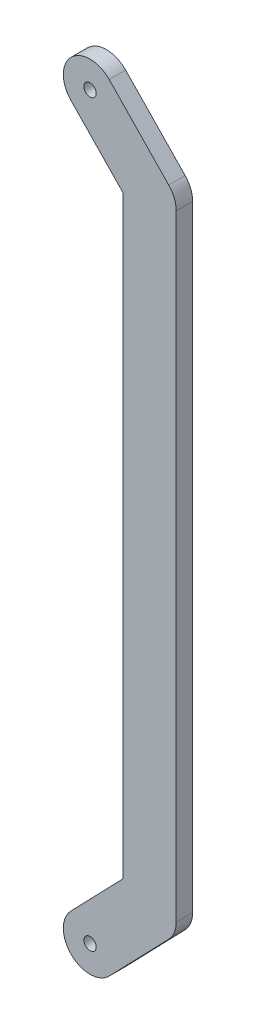
ISO-10303-21;
HEADER;
FILE_DESCRIPTION(('STEP AP214'),'2;1');
FILE_NAME('part.step','',(''),(''),'','','');
FILE_SCHEMA(('AUTOMOTIVE_DESIGN { 1 0 10303 214 1 1 1 1 }'));
ENDSEC;
DATA;
#1=APPLICATION_CONTEXT('core data for automotive mechanical design processes');
#2=APPLICATION_PROTOCOL_DEFINITION('international standard','automotive_design',2000,#1);
#3=PRODUCT_CONTEXT('',#1,'mechanical');
#4=PRODUCT('Part','Part','',(#3));
#5=PRODUCT_RELATED_PRODUCT_CATEGORY('part','',(#4));
#6=PRODUCT_DEFINITION_FORMATION('','',#4);
#7=PRODUCT_DEFINITION_CONTEXT('part definition',#1,'design');
#8=PRODUCT_DEFINITION('design','',#6,#7);
#9=PRODUCT_DEFINITION_SHAPE('','',#8);
#10=(LENGTH_UNIT() NAMED_UNIT(*) SI_UNIT(.MILLI.,.METRE.));
#11=(NAMED_UNIT(*) PLANE_ANGLE_UNIT() SI_UNIT($,.RADIAN.));
#12=(NAMED_UNIT(*) SI_UNIT($,.STERADIAN.) SOLID_ANGLE_UNIT());
#13=UNCERTAINTY_MEASURE_WITH_UNIT(LENGTH_MEASURE(1.E-05),#10,'distance_accuracy_value','');
#14=(GEOMETRIC_REPRESENTATION_CONTEXT(3) GLOBAL_UNCERTAINTY_ASSIGNED_CONTEXT((#13)) GLOBAL_UNIT_ASSIGNED_CONTEXT((#10,
#11,#12)) REPRESENTATION_CONTEXT('',''));
#15=CARTESIAN_POINT('',(0.,0.,0.));
#16=DIRECTION('',(0.,0.,1.));
#17=DIRECTION('',(1.,0.,0.));
#18=AXIS2_PLACEMENT_3D('',#15,#16,#17);
#19=CARTESIAN_POINT('',(7.98533162210616,0.,4.));
#20=DIRECTION('',(-1.,0.,0.));
#21=DIRECTION('',(0.,0.,1.));
#22=AXIS2_PLACEMENT_3D('',#19,#20,#21);
#23=PLANE('',#22);
#24=DIRECTION('',(0.,1.,0.));
#25=VECTOR('',#24,1.);
#26=CARTESIAN_POINT('',(7.98533162210616,0.,0.));
#27=LINE('',#26,#25);
#28=CARTESIAN_POINT('',(7.98533162210616,17.6261704679285,0.));
#29=VERTEX_POINT('',#28);
#30=CARTESIAN_POINT('',(7.98533162210617,162.373829532071,0.));
#31=VERTEX_POINT('',#30);
#32=EDGE_CURVE('E152',#29,#31,#27,.T.);
#33=ORIENTED_EDGE('',*,*,#32,.F.);
#34=DIRECTION('',(0.,0.,-1.));
#35=VECTOR('',#34,1.);
#36=CARTESIAN_POINT('',(7.98533162210616,17.6261704679285,4.));
#37=LINE('',#36,#35);
#38=CARTESIAN_POINT('',(7.98533162210616,17.6261704679285,4.));
#39=VERTEX_POINT('',#38);
#40=EDGE_CURVE('E11',#39,#29,#37,.T.);
#41=ORIENTED_EDGE('',*,*,#40,.F.);
#42=DIRECTION('',(0.,1.,0.));
#43=VECTOR('',#42,1.);
#44=CARTESIAN_POINT('',(7.98533162210616,0.,4.));
#45=LINE('',#44,#43);
#46=CARTESIAN_POINT('',(7.98533162210617,162.373829532071,4.));
#47=VERTEX_POINT('',#46);
#48=EDGE_CURVE('E174',#39,#47,#45,.T.);
#49=ORIENTED_EDGE('',*,*,#48,.T.);
#50=DIRECTION('',(0.,0.,-1.));
#51=VECTOR('',#50,1.);
#52=CARTESIAN_POINT('',(7.98533162210617,162.373829532071,4.));
#53=LINE('',#52,#51);
#54=EDGE_CURVE('E63',#47,#31,#53,.T.);
#55=ORIENTED_EDGE('',*,*,#54,.T.);
#56=EDGE_LOOP('',(#33,#41,#49,#55));
#57=FACE_BOUND('',#56,.T.);
#58=ADVANCED_FACE('F45',(#57),#23,.T.);
#59=CARTESIAN_POINT('',(-4.67570870220122,4.5152794079835,4.));
#60=DIRECTION('',(-0.719339800338649,0.694658370458999,0.));
#61=DIRECTION('',(-0.694658370458999,-0.719339800338649,0.));
#62=AXIS2_PLACEMENT_3D('',#59,#60,#61);
#63=PLANE('',#62);
#64=DIRECTION('',(0.694658370458999,0.719339800338649,0.));
#65=VECTOR('',#64,1.);
#66=CARTESIAN_POINT('',(-4.67570870220122,4.5152794079835,0.));
#67=LINE('',#66,#65);
#68=CARTESIAN_POINT('',(-4.67570870220123,4.51527940798349,0.));
#69=VERTEX_POINT('',#68);
#70=EDGE_CURVE('E154',#69,#29,#67,.T.);
#71=ORIENTED_EDGE('',*,*,#70,.F.);
#72=DIRECTION('',(0.,0.,-1.));
#73=VECTOR('',#72,1.);
#74=CARTESIAN_POINT('',(-4.67570870220123,4.51527940798349,4.));
#75=LINE('',#74,#73);
#76=CARTESIAN_POINT('',(-4.67570870220123,4.51527940798349,4.));
#77=VERTEX_POINT('',#76);
#78=EDGE_CURVE('E54',#77,#69,#75,.T.);
#79=ORIENTED_EDGE('',*,*,#78,.F.);
#80=DIRECTION('',(0.694658370458999,0.719339800338649,0.));
#81=VECTOR('',#80,1.);
#82=CARTESIAN_POINT('',(-4.67570870220122,4.5152794079835,4.));
#83=LINE('',#82,#81);
#84=EDGE_CURVE('E203',#77,#39,#83,.T.);
#85=ORIENTED_EDGE('',*,*,#84,.T.);
#86=ORIENTED_EDGE('',*,*,#40,.T.);
#87=EDGE_LOOP('',(#71,#79,#85,#86));
#88=FACE_BOUND('',#87,.T.);
#89=ADVANCED_FACE('F237',(#88),#63,.T.);
#90=CARTESIAN_POINT('',(0.,0.,4.));
#91=DIRECTION('',(0.,0.,-1.));
#92=DIRECTION('',(-1.,0.,0.));
#93=AXIS2_PLACEMENT_3D('',#90,#91,#92);
#94=CYLINDRICAL_SURFACE('',#93,6.5);
#95=CARTESIAN_POINT('',(0.,0.,0.));
#96=DIRECTION('',(0.,0.,1.));
#97=DIRECTION('',(1.,0.,0.));
#98=AXIS2_PLACEMENT_3D('',#95,#96,#97);
#99=CIRCLE('',#98,6.5);
#100=CARTESIAN_POINT('',(4.67570870220122,-4.51527940798349,0.));
#101=VERTEX_POINT('',#100);
#102=EDGE_CURVE('E158',#69,#101,#99,.T.);
#103=ORIENTED_EDGE('',*,*,#102,.T.);
#104=DIRECTION('',(0.,0.,-1.));
#105=VECTOR('',#104,1.);
#106=CARTESIAN_POINT('',(4.67570870220122,-4.51527940798349,4.));
#107=LINE('',#106,#105);
#108=CARTESIAN_POINT('',(4.67570870220122,-4.51527940798349,4.));
#109=VERTEX_POINT('',#108);
#110=EDGE_CURVE('E187',#109,#101,#107,.T.);
#111=ORIENTED_EDGE('',*,*,#110,.F.);
#112=CARTESIAN_POINT('',(0.,0.,4.));
#113=DIRECTION('',(0.,0.,1.));
#114=DIRECTION('',(1.,0.,0.));
#115=AXIS2_PLACEMENT_3D('',#112,#113,#114);
#116=CIRCLE('',#115,6.5);
#117=EDGE_CURVE('E206',#77,#109,#116,.T.);
#118=ORIENTED_EDGE('',*,*,#117,.F.);
#119=ORIENTED_EDGE('',*,*,#78,.T.);
#120=EDGE_LOOP('',(#103,#111,#118,#119));
#121=FACE_BOUND('',#120,.T.);
#122=ADVANCED_FACE('F241',(#121),#94,.T.);
#123=CARTESIAN_POINT('',(4.67570870220123,-4.51527940798349,4.));
#124=DIRECTION('',(-0.71933980033865,0.694658370458998,0.));
#125=DIRECTION('',(-0.694658370458998,-0.71933980033865,0.));
#126=AXIS2_PLACEMENT_3D('',#123,#124,#125);
#127=PLANE('',#126);
#128=DIRECTION('',(0.694658370458998,0.71933980033865,0.));
#129=VECTOR('',#128,1.);
#130=CARTESIAN_POINT('',(4.67570870220123,-4.51527940798349,0.));
#131=LINE('',#130,#129);
#132=CARTESIAN_POINT('',(19.1610403243074,10.4847205920165,0.));
#133=VERTEX_POINT('',#132);
#134=EDGE_CURVE('E160',#101,#133,#131,.T.);
#135=ORIENTED_EDGE('',*,*,#134,.T.);
#136=DIRECTION('',(0.,0.,-1.));
#137=VECTOR('',#136,1.);
#138=CARTESIAN_POINT('',(19.1610403243074,10.4847205920165,4.));
#139=LINE('',#138,#137);
#140=CARTESIAN_POINT('',(19.1610403243074,10.4847205920165,4.));
#141=VERTEX_POINT('',#140);
#142=EDGE_CURVE('E184',#141,#133,#139,.T.);
#143=ORIENTED_EDGE('',*,*,#142,.F.);
#144=DIRECTION('',(0.694658370458998,0.71933980033865,0.));
#145=VECTOR('',#144,1.);
#146=CARTESIAN_POINT('',(4.67570870220123,-4.51527940798349,4.));
#147=LINE('',#146,#145);
#148=EDGE_CURVE('E208',#109,#141,#147,.T.);
#149=ORIENTED_EDGE('',*,*,#148,.F.);
#150=ORIENTED_EDGE('',*,*,#110,.T.);
#151=EDGE_LOOP('',(#135,#143,#149,#150));
#152=FACE_BOUND('',#151,.T.);
#153=ADVANCED_FACE('F253',(#152),#127,.F.);
#154=CARTESIAN_POINT('',(14.4853316221062,15.,4.));
#155=DIRECTION('',(0.,0.,-1.));
#156=DIRECTION('',(-1.,0.,0.));
#157=AXIS2_PLACEMENT_3D('',#154,#155,#156);
#158=CYLINDRICAL_SURFACE('',#157,6.5);
#159=CARTESIAN_POINT('',(14.4853316221062,15.,0.));
#160=DIRECTION('',(0.,0.,1.));
#161=DIRECTION('',(1.,0.,0.));
#162=AXIS2_PLACEMENT_3D('',#159,#160,#161);
#163=CIRCLE('',#162,6.5);
#164=CARTESIAN_POINT('',(20.9853316221062,15.,0.));
#165=VERTEX_POINT('',#164);
#166=EDGE_CURVE('E162',#133,#165,#163,.T.);
#167=ORIENTED_EDGE('',*,*,#166,.T.);
#168=DIRECTION('',(0.,0.,-1.));
#169=VECTOR('',#168,1.);
#170=CARTESIAN_POINT('',(20.9853316221062,15.,4.));
#171=LINE('',#170,#169);
#172=CARTESIAN_POINT('',(20.9853316221062,15.,4.));
#173=VERTEX_POINT('',#172);
#174=EDGE_CURVE('E181',#173,#165,#171,.T.);
#175=ORIENTED_EDGE('',*,*,#174,.F.);
#176=CARTESIAN_POINT('',(14.4853316221062,15.,4.));
#177=DIRECTION('',(0.,0.,1.));
#178=DIRECTION('',(1.,0.,0.));
#179=AXIS2_PLACEMENT_3D('',#176,#177,#178);
#180=CIRCLE('',#179,6.5);
#181=EDGE_CURVE('E210',#141,#173,#180,.T.);
#182=ORIENTED_EDGE('',*,*,#181,.F.);
#183=ORIENTED_EDGE('',*,*,#142,.T.);
#184=EDGE_LOOP('',(#167,#175,#182,#183));
#185=FACE_BOUND('',#184,.T.);
#186=ADVANCED_FACE('F256',(#185),#158,.T.);
#187=CARTESIAN_POINT('',(20.9853316221062,0.,4.));
#188=DIRECTION('',(-1.,0.,0.));
#189=DIRECTION('',(0.,0.,1.));
#190=AXIS2_PLACEMENT_3D('',#187,#188,#189);
#191=PLANE('',#190);
#192=DIRECTION('',(0.,1.,0.));
#193=VECTOR('',#192,1.);
#194=CARTESIAN_POINT('',(20.9853316221062,0.,0.));
#195=LINE('',#194,#193);
#196=CARTESIAN_POINT('',(20.9853316221062,165.,0.));
#197=VERTEX_POINT('',#196);
#198=EDGE_CURVE('E164',#165,#197,#195,.T.);
#199=ORIENTED_EDGE('',*,*,#198,.T.);
#200=DIRECTION('',(0.,0.,-1.));
#201=VECTOR('',#200,1.);
#202=CARTESIAN_POINT('',(20.9853316221062,165.,4.));
#203=LINE('',#202,#201);
#204=CARTESIAN_POINT('',(20.9853316221062,165.,4.));
#205=VERTEX_POINT('',#204);
#206=EDGE_CURVE('E178',#205,#197,#203,.T.);
#207=ORIENTED_EDGE('',*,*,#206,.F.);
#208=DIRECTION('',(0.,1.,0.));
#209=VECTOR('',#208,1.);
#210=CARTESIAN_POINT('',(20.9853316221062,0.,4.));
#211=LINE('',#210,#209);
#212=EDGE_CURVE('E212',#173,#205,#211,.T.);
#213=ORIENTED_EDGE('',*,*,#212,.F.);
#214=ORIENTED_EDGE('',*,*,#174,.T.);
#215=EDGE_LOOP('',(#199,#207,#213,#214));
#216=FACE_BOUND('',#215,.T.);
#217=ADVANCED_FACE('F218',(#216),#191,.F.);
#218=CARTESIAN_POINT('',(14.4853316221062,165.,4.));
#219=DIRECTION('',(0.,0.,-1.));
#220=DIRECTION('',(-1.,0.,0.));
#221=AXIS2_PLACEMENT_3D('',#218,#219,#220);
#222=CYLINDRICAL_SURFACE('',#221,6.5);
#223=CARTESIAN_POINT('',(14.4853316221062,165.,0.));
#224=DIRECTION('',(0.,0.,1.));
#225=DIRECTION('',(1.,0.,0.));
#226=AXIS2_PLACEMENT_3D('',#223,#224,#225);
#227=CIRCLE('',#226,6.5);
#228=CARTESIAN_POINT('',(19.1610403243074,169.515279407983,0.));
#229=VERTEX_POINT('',#228);
#230=EDGE_CURVE('E166',#197,#229,#227,.T.);
#231=ORIENTED_EDGE('',*,*,#230,.T.);
#232=DIRECTION('',(0.,0.,-1.));
#233=VECTOR('',#232,1.);
#234=CARTESIAN_POINT('',(19.1610403243074,169.515279407983,4.));
#235=LINE('',#234,#233);
#236=CARTESIAN_POINT('',(19.1610403243074,169.515279407983,4.));
#237=VERTEX_POINT('',#236);
#238=EDGE_CURVE('E144',#237,#229,#235,.T.);
#239=ORIENTED_EDGE('',*,*,#238,.F.);
#240=CARTESIAN_POINT('',(14.4853316221062,165.,4.));
#241=DIRECTION('',(0.,0.,1.));
#242=DIRECTION('',(1.,0.,0.));
#243=AXIS2_PLACEMENT_3D('',#240,#241,#242);
#244=CIRCLE('',#243,6.5);
#245=EDGE_CURVE('E132',#205,#237,#244,.T.);
#246=ORIENTED_EDGE('',*,*,#245,.F.);
#247=ORIENTED_EDGE('',*,*,#206,.T.);
#248=EDGE_LOOP('',(#231,#239,#246,#247));
#249=FACE_BOUND('',#248,.T.);
#250=ADVANCED_FACE('F222',(#249),#222,.T.);
#251=CARTESIAN_POINT('',(94.6208831339198,91.3743247047588,4.));
#252=DIRECTION('',(-0.71933980033865,-0.694658370458999,0.));
#253=DIRECTION('',(0.694658370458999,-0.71933980033865,0.));
#254=AXIS2_PLACEMENT_3D('',#251,#252,#253);
#255=PLANE('',#254);
#256=DIRECTION('',(-0.694658370458999,0.71933980033865,0.));
#257=VECTOR('',#256,1.);
#258=CARTESIAN_POINT('',(94.6208831339198,91.3743247047588,0.));
#259=LINE('',#258,#257);
#260=CARTESIAN_POINT('',(4.67570870220119,184.515279407983,0.));
#261=VERTEX_POINT('',#260);
#262=EDGE_CURVE('E141',#229,#261,#259,.T.);
#263=ORIENTED_EDGE('',*,*,#262,.T.);
#264=DIRECTION('',(0.,0.,-1.));
#265=VECTOR('',#264,1.);
#266=CARTESIAN_POINT('',(4.67570870220119,184.515279407983,4.));
#267=LINE('',#266,#265);
#268=CARTESIAN_POINT('',(4.67570870220119,184.515279407983,4.));
#269=VERTEX_POINT('',#268);
#270=EDGE_CURVE('E138',#269,#261,#267,.T.);
#271=ORIENTED_EDGE('',*,*,#270,.F.);
#272=DIRECTION('',(-0.694658370458999,0.71933980033865,0.));
#273=VECTOR('',#272,1.);
#274=CARTESIAN_POINT('',(94.6208831339198,91.3743247047588,4.));
#275=LINE('',#274,#273);
#276=EDGE_CURVE('E125',#237,#269,#275,.T.);
#277=ORIENTED_EDGE('',*,*,#276,.F.);
#278=ORIENTED_EDGE('',*,*,#238,.T.);
#279=EDGE_LOOP('',(#263,#271,#277,#278));
#280=FACE_BOUND('',#279,.T.);
#281=ADVANCED_FACE('F139',(#280),#255,.F.);
#282=CARTESIAN_POINT('',(0.,180.,4.));
#283=DIRECTION('',(0.,0.,-1.));
#284=DIRECTION('',(-1.,0.,0.));
#285=AXIS2_PLACEMENT_3D('',#282,#283,#284);
#286=CYLINDRICAL_SURFACE('',#285,6.5);
#287=CARTESIAN_POINT('',(0.,180.,0.));
#288=DIRECTION('',(0.,0.,1.));
#289=DIRECTION('',(1.,0.,0.));
#290=AXIS2_PLACEMENT_3D('',#287,#288,#289);
#291=CIRCLE('',#290,6.5);
#292=CARTESIAN_POINT('',(-4.67570870220123,175.484720592017,0.));
#293=VERTEX_POINT('',#292);
#294=EDGE_CURVE('E169',#261,#293,#291,.T.);
#295=ORIENTED_EDGE('',*,*,#294,.T.);
#296=DIRECTION('',(0.,0.,-1.));
#297=VECTOR('',#296,1.);
#298=CARTESIAN_POINT('',(-4.67570870220123,175.484720592017,4.));
#299=LINE('',#298,#297);
#300=CARTESIAN_POINT('',(-4.67570870220123,175.484720592017,4.));
#301=VERTEX_POINT('',#300);
#302=EDGE_CURVE('E95',#301,#293,#299,.T.);
#303=ORIENTED_EDGE('',*,*,#302,.F.);
#304=CARTESIAN_POINT('',(0.,180.,4.));
#305=DIRECTION('',(0.,0.,1.));
#306=DIRECTION('',(1.,0.,0.));
#307=AXIS2_PLACEMENT_3D('',#304,#305,#306);
#308=CIRCLE('',#307,6.5);
#309=EDGE_CURVE('E130',#269,#301,#308,.T.);
#310=ORIENTED_EDGE('',*,*,#309,.F.);
#311=ORIENTED_EDGE('',*,*,#270,.T.);
#312=EDGE_LOOP('',(#295,#303,#310,#311));
#313=FACE_BOUND('',#312,.T.);
#314=ADVANCED_FACE('F146',(#313),#286,.T.);
#315=CARTESIAN_POINT('',(85.2694657295174,82.3437658887917,4.));
#316=DIRECTION('',(-0.71933980033865,-0.694658370458999,0.));
#317=DIRECTION('',(0.694658370458999,-0.71933980033865,0.));
#318=AXIS2_PLACEMENT_3D('',#315,#316,#317);
#319=PLANE('',#318);
#320=DIRECTION('',(-0.694658370458999,0.71933980033865,0.));
#321=VECTOR('',#320,1.);
#322=CARTESIAN_POINT('',(85.2694657295174,82.3437658887917,0.));
#323=LINE('',#322,#321);
#324=EDGE_CURVE('E171',#31,#293,#323,.T.);
#325=ORIENTED_EDGE('',*,*,#324,.F.);
#326=ORIENTED_EDGE('',*,*,#54,.F.);
#327=DIRECTION('',(-0.694658370458999,0.71933980033865,0.));
#328=VECTOR('',#327,1.);
#329=CARTESIAN_POINT('',(85.2694657295174,82.3437658887917,4.));
#330=LINE('',#329,#328);
#331=EDGE_CURVE('E147',#47,#301,#330,.T.);
#332=ORIENTED_EDGE('',*,*,#331,.T.);
#333=ORIENTED_EDGE('',*,*,#302,.T.);
#334=EDGE_LOOP('',(#325,#326,#332,#333));
#335=FACE_BOUND('',#334,.T.);
#336=ADVANCED_FACE('F225',(#335),#319,.T.);
#337=CARTESIAN_POINT('',(0.,0.,4.));
#338=DIRECTION('',(0.,0.,1.));
#339=DIRECTION('',(1.,0.,0.));
#340=AXIS2_PLACEMENT_3D('',#337,#338,#339);
#341=PLANE('',#340);
#342=CARTESIAN_POINT('',(0.,0.,4.));
#343=DIRECTION('',(0.,0.,1.));
#344=DIRECTION('',(1.,0.,0.));
#345=AXIS2_PLACEMENT_3D('',#342,#343,#344);
#346=CIRCLE('',#345,1.5);
#347=CARTESIAN_POINT('',(1.5,0.,4.));
#348=VERTEX_POINT('',#347);
#349=EDGE_CURVE('E199',#348,#348,#346,.T.);
#350=ORIENTED_EDGE('',*,*,#349,.F.);
#351=EDGE_LOOP('',(#350));
#352=FACE_BOUND('',#351,.T.);
#353=CARTESIAN_POINT('',(0.,180.,4.));
#354=DIRECTION('',(0.,0.,1.));
#355=DIRECTION('',(1.,0.,0.));
#356=AXIS2_PLACEMENT_3D('',#353,#354,#355);
#357=CIRCLE('',#356,1.5);
#358=CARTESIAN_POINT('',(1.5,180.,4.));
#359=VERTEX_POINT('',#358);
#360=EDGE_CURVE('E191',#359,#359,#357,.T.);
#361=ORIENTED_EDGE('',*,*,#360,.F.);
#362=EDGE_LOOP('',(#361));
#363=FACE_BOUND('',#362,.T.);
#364=ORIENTED_EDGE('',*,*,#48,.F.);
#365=ORIENTED_EDGE('',*,*,#84,.F.);
#366=ORIENTED_EDGE('',*,*,#117,.T.);
#367=ORIENTED_EDGE('',*,*,#148,.T.);
#368=ORIENTED_EDGE('',*,*,#181,.T.);
#369=ORIENTED_EDGE('',*,*,#212,.T.);
#370=ORIENTED_EDGE('',*,*,#245,.T.);
#371=ORIENTED_EDGE('',*,*,#276,.T.);
#372=ORIENTED_EDGE('',*,*,#309,.T.);
#373=ORIENTED_EDGE('',*,*,#331,.F.);
#374=EDGE_LOOP('',(#364,#365,#366,#367,#368,#369,#370,#371,#372,#373));
#375=FACE_BOUND('',#374,.T.);
#376=ADVANCED_FACE('F127',(#352,#363,#375),#341,.T.);
#377=CARTESIAN_POINT('',(0.,0.,0.));
#378=DIRECTION('',(0.,0.,1.));
#379=DIRECTION('',(1.,0.,0.));
#380=AXIS2_PLACEMENT_3D('',#377,#378,#379);
#381=PLANE('',#380);
#382=CARTESIAN_POINT('',(0.,0.,0.));
#383=DIRECTION('',(0.,0.,1.));
#384=DIRECTION('',(1.,0.,0.));
#385=AXIS2_PLACEMENT_3D('',#382,#383,#384);
#386=CIRCLE('',#385,1.5);
#387=CARTESIAN_POINT('',(1.5,0.,0.));
#388=VERTEX_POINT('',#387);
#389=EDGE_CURVE('E48',#388,#388,#386,.T.);
#390=ORIENTED_EDGE('',*,*,#389,.T.);
#391=EDGE_LOOP('',(#390));
#392=FACE_BOUND('',#391,.T.);
#393=CARTESIAN_POINT('',(0.,180.,0.));
#394=DIRECTION('',(0.,0.,1.));
#395=DIRECTION('',(1.,0.,0.));
#396=AXIS2_PLACEMENT_3D('',#393,#394,#395);
#397=CIRCLE('',#396,1.5);
#398=CARTESIAN_POINT('',(1.5,180.,0.));
#399=VERTEX_POINT('',#398);
#400=EDGE_CURVE('E155',#399,#399,#397,.T.);
#401=ORIENTED_EDGE('',*,*,#400,.T.);
#402=EDGE_LOOP('',(#401));
#403=FACE_BOUND('',#402,.T.);
#404=ORIENTED_EDGE('',*,*,#32,.T.);
#405=ORIENTED_EDGE('',*,*,#324,.T.);
#406=ORIENTED_EDGE('',*,*,#294,.F.);
#407=ORIENTED_EDGE('',*,*,#262,.F.);
#408=ORIENTED_EDGE('',*,*,#230,.F.);
#409=ORIENTED_EDGE('',*,*,#198,.F.);
#410=ORIENTED_EDGE('',*,*,#166,.F.);
#411=ORIENTED_EDGE('',*,*,#134,.F.);
#412=ORIENTED_EDGE('',*,*,#102,.F.);
#413=ORIENTED_EDGE('',*,*,#70,.T.);
#414=EDGE_LOOP('',(#404,#405,#406,#407,#408,#409,#410,#411,#412,#413));
#415=FACE_BOUND('',#414,.T.);
#416=ADVANCED_FACE('F224',(#392,#403,#415),#381,.F.);
#417=CARTESIAN_POINT('',(0.,180.,4.));
#418=DIRECTION('',(0.,0.,1.));
#419=DIRECTION('',(1.,0.,0.));
#420=AXIS2_PLACEMENT_3D('',#417,#418,#419);
#421=CYLINDRICAL_SURFACE('',#420,1.5);
#422=ORIENTED_EDGE('',*,*,#360,.T.);
#423=EDGE_LOOP('',(#422));
#424=FACE_BOUND('',#423,.T.);
#425=ORIENTED_EDGE('',*,*,#400,.F.);
#426=EDGE_LOOP('',(#425));
#427=FACE_BOUND('',#426,.T.);
#428=ADVANCED_FACE('F326',(#424,#427),#421,.F.);
#429=CARTESIAN_POINT('',(0.,0.,4.));
#430=DIRECTION('',(0.,0.,1.));
#431=DIRECTION('',(1.,0.,0.));
#432=AXIS2_PLACEMENT_3D('',#429,#430,#431);
#433=CYLINDRICAL_SURFACE('',#432,1.5);
#434=ORIENTED_EDGE('',*,*,#349,.T.);
#435=EDGE_LOOP('',(#434));
#436=FACE_BOUND('',#435,.T.);
#437=ORIENTED_EDGE('',*,*,#389,.F.);
#438=EDGE_LOOP('',(#437));
#439=FACE_BOUND('',#438,.T.);
#440=ADVANCED_FACE('F336',(#436,#439),#433,.F.);
#441=CLOSED_SHELL('',(#58,#89,#122,#153,#186,#217,#250,#281,#314,#336,#376,#416,#428,#440));
#442=MANIFOLD_SOLID_BREP('B2',#441);
#443=ADVANCED_BREP_SHAPE_REPRESENTATION('',(#18,#442),#14);
#444=SHAPE_DEFINITION_REPRESENTATION(#9,#443);
ENDSEC;
END-ISO-10303-21;
